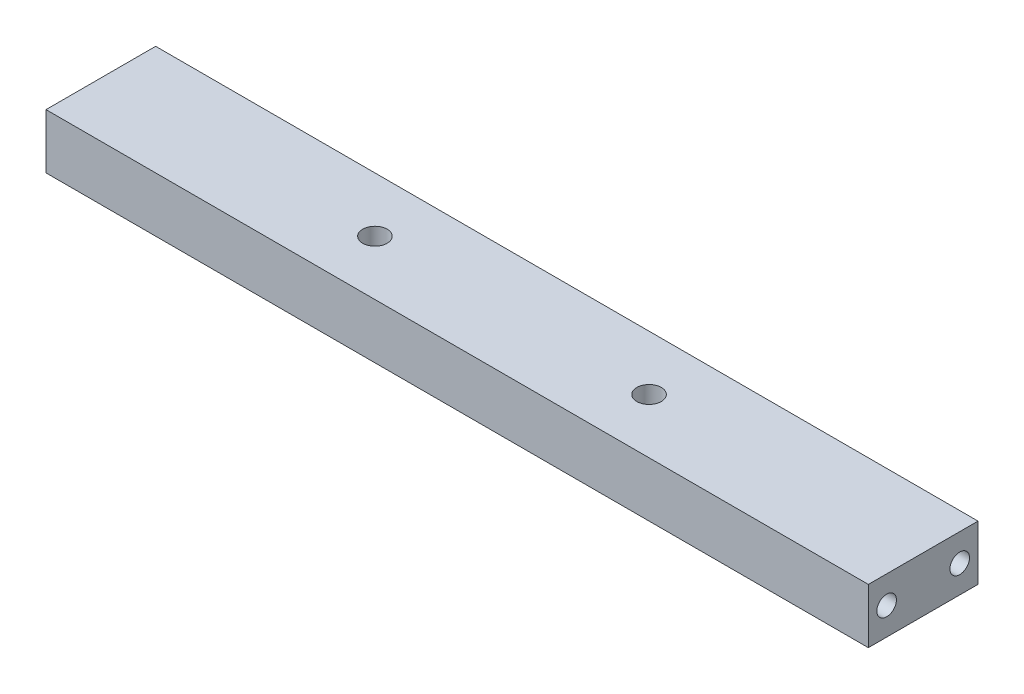
ISO-10303-21;
HEADER;
FILE_DESCRIPTION(('STEP AP214'),'2;1');
FILE_NAME('part.step','',(''),(''),'','','');
FILE_SCHEMA(('AUTOMOTIVE_DESIGN { 1 0 10303 214 1 1 1 1 }'));
ENDSEC;
DATA;
#1=APPLICATION_CONTEXT('core data for automotive mechanical design processes');
#2=APPLICATION_PROTOCOL_DEFINITION('international standard','automotive_design',2000,#1);
#3=PRODUCT_CONTEXT('',#1,'mechanical');
#4=PRODUCT('Part','Part','',(#3));
#5=PRODUCT_RELATED_PRODUCT_CATEGORY('part','',(#4));
#6=PRODUCT_DEFINITION_FORMATION('','',#4);
#7=PRODUCT_DEFINITION_CONTEXT('part definition',#1,'design');
#8=PRODUCT_DEFINITION('design','',#6,#7);
#9=PRODUCT_DEFINITION_SHAPE('','',#8);
#10=(LENGTH_UNIT() NAMED_UNIT(*) SI_UNIT(.MILLI.,.METRE.));
#11=(NAMED_UNIT(*) PLANE_ANGLE_UNIT() SI_UNIT($,.RADIAN.));
#12=(NAMED_UNIT(*) SI_UNIT($,.STERADIAN.) SOLID_ANGLE_UNIT());
#13=UNCERTAINTY_MEASURE_WITH_UNIT(LENGTH_MEASURE(1.E-05),#10,'distance_accuracy_value','');
#14=(GEOMETRIC_REPRESENTATION_CONTEXT(3) GLOBAL_UNCERTAINTY_ASSIGNED_CONTEXT((#13)) GLOBAL_UNIT_ASSIGNED_CONTEXT((#10,
#11,#12)) REPRESENTATION_CONTEXT('',''));
#15=CARTESIAN_POINT('',(0.,0.,0.));
#16=DIRECTION('',(0.,0.,1.));
#17=DIRECTION('',(1.,0.,0.));
#18=AXIS2_PLACEMENT_3D('',#15,#16,#17);
#19=CARTESIAN_POINT('',(142.875,9.525,19.05));
#20=DIRECTION('',(0.,0.,-1.));
#21=DIRECTION('',(0.,1.,0.));
#22=AXIS2_PLACEMENT_3D('',#19,#20,#21);
#23=PLANE('',#22);
#24=DIRECTION('',(0.,-1.,0.));
#25=VECTOR('',#24,1.);
#26=CARTESIAN_POINT('',(-142.875,9.525,19.05));
#27=LINE('',#26,#25);
#28=CARTESIAN_POINT('',(-142.875,9.525,19.05));
#29=VERTEX_POINT('',#28);
#30=CARTESIAN_POINT('',(-142.875,-9.525,19.05));
#31=VERTEX_POINT('',#30);
#32=EDGE_CURVE('E197',#29,#31,#27,.T.);
#33=ORIENTED_EDGE('',*,*,#32,.T.);
#34=DIRECTION('',(-1.,0.,0.));
#35=VECTOR('',#34,1.);
#36=CARTESIAN_POINT('',(142.875,-9.525,19.05));
#37=LINE('',#36,#35);
#38=CARTESIAN_POINT('',(142.875,-9.525,19.05));
#39=VERTEX_POINT('',#38);
#40=EDGE_CURVE('E11',#39,#31,#37,.T.);
#41=ORIENTED_EDGE('',*,*,#40,.F.);
#42=DIRECTION('',(0.,-1.,0.));
#43=VECTOR('',#42,1.);
#44=CARTESIAN_POINT('',(142.875,9.525,19.05));
#45=LINE('',#44,#43);
#46=CARTESIAN_POINT('',(142.875,9.525,19.05));
#47=VERTEX_POINT('',#46);
#48=EDGE_CURVE('E198',#47,#39,#45,.T.);
#49=ORIENTED_EDGE('',*,*,#48,.F.);
#50=DIRECTION('',(-1.,0.,0.));
#51=VECTOR('',#50,1.);
#52=CARTESIAN_POINT('',(142.875,9.525,19.05));
#53=LINE('',#52,#51);
#54=EDGE_CURVE('E204',#47,#29,#53,.T.);
#55=ORIENTED_EDGE('',*,*,#54,.T.);
#56=EDGE_LOOP('',(#33,#41,#49,#55));
#57=FACE_BOUND('',#56,.T.);
#58=ADVANCED_FACE('F38',(#57),#23,.F.);
#59=CARTESIAN_POINT('',(142.875,-9.525,19.05));
#60=DIRECTION('',(0.,1.,0.));
#61=DIRECTION('',(0.,0.,1.));
#62=AXIS2_PLACEMENT_3D('',#59,#60,#61);
#63=PLANE('',#62);
#64=CARTESIAN_POINT('',(19.05,-9.525,-12.7));
#65=DIRECTION('',(0.,-1.,0.));
#66=DIRECTION('',(0.,0.,-1.));
#67=AXIS2_PLACEMENT_3D('',#64,#65,#66);
#68=CIRCLE('',#67,2.1);
#69=CARTESIAN_POINT('',(19.05,-9.525,-14.8));
#70=VERTEX_POINT('',#69);
#71=EDGE_CURVE('E127',#70,#70,#68,.T.);
#72=ORIENTED_EDGE('',*,*,#71,.F.);
#73=EDGE_LOOP('',(#72));
#74=FACE_BOUND('',#73,.T.);
#75=CARTESIAN_POINT('',(-19.05,-9.525,-12.7));
#76=DIRECTION('',(0.,-1.,0.));
#77=DIRECTION('',(0.,0.,-1.));
#78=AXIS2_PLACEMENT_3D('',#75,#76,#77);
#79=CIRCLE('',#78,2.1);
#80=CARTESIAN_POINT('',(-19.05,-9.525,-14.8));
#81=VERTEX_POINT('',#80);
#82=EDGE_CURVE('E126',#81,#81,#79,.T.);
#83=ORIENTED_EDGE('',*,*,#82,.F.);
#84=EDGE_LOOP('',(#83));
#85=FACE_BOUND('',#84,.T.);
#86=CARTESIAN_POINT('',(-19.05,-9.525,12.7));
#87=DIRECTION('',(0.,-1.,0.));
#88=DIRECTION('',(0.,0.,-1.));
#89=AXIS2_PLACEMENT_3D('',#86,#87,#88);
#90=CIRCLE('',#89,2.1);
#91=CARTESIAN_POINT('',(-19.05,-9.525,10.6));
#92=VERTEX_POINT('',#91);
#93=EDGE_CURVE('E137',#92,#92,#90,.T.);
#94=ORIENTED_EDGE('',*,*,#93,.F.);
#95=EDGE_LOOP('',(#94));
#96=FACE_BOUND('',#95,.T.);
#97=CARTESIAN_POINT('',(19.05,-9.525,12.7));
#98=DIRECTION('',(0.,-1.,0.));
#99=DIRECTION('',(0.,0.,-1.));
#100=AXIS2_PLACEMENT_3D('',#97,#98,#99);
#101=CIRCLE('',#100,2.1);
#102=CARTESIAN_POINT('',(19.05,-9.525,10.6));
#103=VERTEX_POINT('',#102);
#104=EDGE_CURVE('E143',#103,#103,#101,.T.);
#105=ORIENTED_EDGE('',*,*,#104,.F.);
#106=EDGE_LOOP('',(#105));
#107=FACE_BOUND('',#106,.T.);
#108=CARTESIAN_POINT('',(-47.625,-9.525,0.));
#109=DIRECTION('',(0.,1.,0.));
#110=DIRECTION('',(0.,0.,1.));
#111=AXIS2_PLACEMENT_3D('',#108,#109,#110);
#112=CIRCLE('',#111,4.25);
#113=CARTESIAN_POINT('',(-47.625,-9.525,4.25));
#114=VERTEX_POINT('',#113);
#115=EDGE_CURVE('E164',#114,#114,#112,.T.);
#116=ORIENTED_EDGE('',*,*,#115,.T.);
#117=EDGE_LOOP('',(#116));
#118=FACE_BOUND('',#117,.T.);
#119=CARTESIAN_POINT('',(47.625,-9.525,0.));
#120=DIRECTION('',(0.,1.,0.));
#121=DIRECTION('',(0.,0.,1.));
#122=AXIS2_PLACEMENT_3D('',#119,#120,#121);
#123=CIRCLE('',#122,4.25);
#124=CARTESIAN_POINT('',(47.625,-9.525,4.25));
#125=VERTEX_POINT('',#124);
#126=EDGE_CURVE('E170',#125,#125,#123,.T.);
#127=ORIENTED_EDGE('',*,*,#126,.T.);
#128=EDGE_LOOP('',(#127));
#129=FACE_BOUND('',#128,.T.);
#130=DIRECTION('',(0.,0.,-1.));
#131=VECTOR('',#130,1.);
#132=CARTESIAN_POINT('',(-142.875,-9.525,19.05));
#133=LINE('',#132,#131);
#134=CARTESIAN_POINT('',(-142.875,-9.525,-19.05));
#135=VERTEX_POINT('',#134);
#136=EDGE_CURVE('E207',#31,#135,#133,.T.);
#137=ORIENTED_EDGE('',*,*,#136,.T.);
#138=DIRECTION('',(-1.,0.,0.));
#139=VECTOR('',#138,1.);
#140=CARTESIAN_POINT('',(142.875,-9.525,-19.05));
#141=LINE('',#140,#139);
#142=CARTESIAN_POINT('',(142.875,-9.525,-19.05));
#143=VERTEX_POINT('',#142);
#144=EDGE_CURVE('E46',#143,#135,#141,.T.);
#145=ORIENTED_EDGE('',*,*,#144,.F.);
#146=DIRECTION('',(0.,0.,-1.));
#147=VECTOR('',#146,1.);
#148=CARTESIAN_POINT('',(142.875,-9.525,19.05));
#149=LINE('',#148,#147);
#150=EDGE_CURVE('E85',#39,#143,#149,.T.);
#151=ORIENTED_EDGE('',*,*,#150,.F.);
#152=ORIENTED_EDGE('',*,*,#40,.T.);
#153=EDGE_LOOP('',(#137,#145,#151,#152));
#154=FACE_BOUND('',#153,.T.);
#155=ADVANCED_FACE('F232',(#74,#85,#96,#107,#118,#129,#154),#63,.F.);
#156=CARTESIAN_POINT('',(142.875,9.525,-19.05));
#157=DIRECTION('',(0.,0.,1.));
#158=DIRECTION('',(0.,-1.,0.));
#159=AXIS2_PLACEMENT_3D('',#156,#157,#158);
#160=PLANE('',#159);
#161=CARTESIAN_POINT('',(63.5,0.,-19.05));
#162=DIRECTION('',(0.,0.,-1.));
#163=DIRECTION('',(-1.,0.,0.));
#164=AXIS2_PLACEMENT_3D('',#161,#162,#163);
#165=CIRCLE('',#164,2.1);
#166=CARTESIAN_POINT('',(61.4,0.,-19.05));
#167=VERTEX_POINT('',#166);
#168=EDGE_CURVE('E149',#167,#167,#165,.T.);
#169=ORIENTED_EDGE('',*,*,#168,.F.);
#170=EDGE_LOOP('',(#169));
#171=FACE_BOUND('',#170,.T.);
#172=CARTESIAN_POINT('',(-63.5,0.,-19.05));
#173=DIRECTION('',(0.,0.,-1.));
#174=DIRECTION('',(-1.,0.,0.));
#175=AXIS2_PLACEMENT_3D('',#172,#173,#174);
#176=CIRCLE('',#175,2.1);
#177=CARTESIAN_POINT('',(-65.6,0.,-19.05));
#178=VERTEX_POINT('',#177);
#179=EDGE_CURVE('E155',#178,#178,#176,.T.);
#180=ORIENTED_EDGE('',*,*,#179,.F.);
#181=EDGE_LOOP('',(#180));
#182=FACE_BOUND('',#181,.T.);
#183=DIRECTION('',(0.,1.,0.));
#184=VECTOR('',#183,1.);
#185=CARTESIAN_POINT('',(-142.875,9.525,-19.05));
#186=LINE('',#185,#184);
#187=CARTESIAN_POINT('',(-142.875,9.525,-19.05));
#188=VERTEX_POINT('',#187);
#189=EDGE_CURVE('E72',#135,#188,#186,.T.);
#190=ORIENTED_EDGE('',*,*,#189,.T.);
#191=DIRECTION('',(-1.,0.,0.));
#192=VECTOR('',#191,1.);
#193=CARTESIAN_POINT('',(142.875,9.525,-19.05));
#194=LINE('',#193,#192);
#195=CARTESIAN_POINT('',(142.875,9.525,-19.05));
#196=VERTEX_POINT('',#195);
#197=EDGE_CURVE('E212',#196,#188,#194,.T.);
#198=ORIENTED_EDGE('',*,*,#197,.F.);
#199=DIRECTION('',(0.,1.,0.));
#200=VECTOR('',#199,1.);
#201=CARTESIAN_POINT('',(142.875,9.525,-19.05));
#202=LINE('',#201,#200);
#203=EDGE_CURVE('E201',#143,#196,#202,.T.);
#204=ORIENTED_EDGE('',*,*,#203,.F.);
#205=ORIENTED_EDGE('',*,*,#144,.T.);
#206=EDGE_LOOP('',(#190,#198,#204,#205));
#207=FACE_BOUND('',#206,.T.);
#208=ADVANCED_FACE('F214',(#171,#182,#207),#160,.F.);
#209=CARTESIAN_POINT('',(142.875,9.525,19.05));
#210=DIRECTION('',(0.,-1.,0.));
#211=DIRECTION('',(0.,0.,-1.));
#212=AXIS2_PLACEMENT_3D('',#209,#210,#211);
#213=PLANE('',#212);
#214=CARTESIAN_POINT('',(-47.625,9.525,0.));
#215=DIRECTION('',(0.,1.,0.));
#216=DIRECTION('',(0.,0.,1.));
#217=AXIS2_PLACEMENT_3D('',#214,#215,#216);
#218=CIRCLE('',#217,4.24999999999999);
#219=CARTESIAN_POINT('',(-47.625,9.525,4.24999999999999));
#220=VERTEX_POINT('',#219);
#221=EDGE_CURVE('E161',#220,#220,#218,.T.);
#222=ORIENTED_EDGE('',*,*,#221,.F.);
#223=EDGE_LOOP('',(#222));
#224=FACE_BOUND('',#223,.T.);
#225=CARTESIAN_POINT('',(47.625,9.525,0.));
#226=DIRECTION('',(0.,1.,0.));
#227=DIRECTION('',(0.,0.,1.));
#228=AXIS2_PLACEMENT_3D('',#225,#226,#227);
#229=CIRCLE('',#228,4.24999999999999);
#230=CARTESIAN_POINT('',(47.625,9.525,4.24999999999999));
#231=VERTEX_POINT('',#230);
#232=EDGE_CURVE('E167',#231,#231,#229,.T.);
#233=ORIENTED_EDGE('',*,*,#232,.F.);
#234=EDGE_LOOP('',(#233));
#235=FACE_BOUND('',#234,.T.);
#236=DIRECTION('',(0.,0.,1.));
#237=VECTOR('',#236,1.);
#238=CARTESIAN_POINT('',(-142.875,9.525,19.05));
#239=LINE('',#238,#237);
#240=EDGE_CURVE('E78',#188,#29,#239,.T.);
#241=ORIENTED_EDGE('',*,*,#240,.T.);
#242=ORIENTED_EDGE('',*,*,#54,.F.);
#243=DIRECTION('',(0.,0.,1.));
#244=VECTOR('',#243,1.);
#245=CARTESIAN_POINT('',(142.875,9.525,19.05));
#246=LINE('',#245,#244);
#247=EDGE_CURVE('E54',#196,#47,#246,.T.);
#248=ORIENTED_EDGE('',*,*,#247,.F.);
#249=ORIENTED_EDGE('',*,*,#197,.T.);
#250=EDGE_LOOP('',(#241,#242,#248,#249));
#251=FACE_BOUND('',#250,.T.);
#252=ADVANCED_FACE('F221',(#224,#235,#251),#213,.F.);
#253=CARTESIAN_POINT('',(142.875,9.525,19.05));
#254=DIRECTION('',(1.,0.,0.));
#255=DIRECTION('',(0.,0.,-1.));
#256=AXIS2_PLACEMENT_3D('',#253,#254,#255);
#257=PLANE('',#256);
#258=CARTESIAN_POINT('',(142.875,0.,12.7));
#259=DIRECTION('',(1.,0.,0.));
#260=DIRECTION('',(0.,0.,-1.));
#261=AXIS2_PLACEMENT_3D('',#258,#259,#260);
#262=CIRCLE('',#261,3.4);
#263=CARTESIAN_POINT('',(142.875,0.,9.3));
#264=VERTEX_POINT('',#263);
#265=EDGE_CURVE('E188',#264,#264,#262,.T.);
#266=ORIENTED_EDGE('',*,*,#265,.F.);
#267=EDGE_LOOP('',(#266));
#268=FACE_BOUND('',#267,.T.);
#269=CARTESIAN_POINT('',(142.875,0.,-12.7));
#270=DIRECTION('',(1.,0.,0.));
#271=DIRECTION('',(0.,0.,-1.));
#272=AXIS2_PLACEMENT_3D('',#269,#270,#271);
#273=CIRCLE('',#272,3.4);
#274=CARTESIAN_POINT('',(142.875,0.,-16.1));
#275=VERTEX_POINT('',#274);
#276=EDGE_CURVE('E194',#275,#275,#273,.T.);
#277=ORIENTED_EDGE('',*,*,#276,.F.);
#278=EDGE_LOOP('',(#277));
#279=FACE_BOUND('',#278,.T.);
#280=ORIENTED_EDGE('',*,*,#48,.T.);
#281=ORIENTED_EDGE('',*,*,#150,.T.);
#282=ORIENTED_EDGE('',*,*,#203,.T.);
#283=ORIENTED_EDGE('',*,*,#247,.T.);
#284=EDGE_LOOP('',(#280,#281,#282,#283));
#285=FACE_BOUND('',#284,.T.);
#286=ADVANCED_FACE('F223',(#268,#279,#285),#257,.T.);
#287=CARTESIAN_POINT('',(-142.875,9.525,19.05));
#288=DIRECTION('',(1.,0.,0.));
#289=DIRECTION('',(0.,0.,-1.));
#290=AXIS2_PLACEMENT_3D('',#287,#288,#289);
#291=PLANE('',#290);
#292=CARTESIAN_POINT('',(-142.875,0.,12.7));
#293=DIRECTION('',(-1.,0.,0.));
#294=DIRECTION('',(0.,0.,1.));
#295=AXIS2_PLACEMENT_3D('',#292,#293,#294);
#296=CIRCLE('',#295,3.4);
#297=CARTESIAN_POINT('',(-142.875,0.,16.1));
#298=VERTEX_POINT('',#297);
#299=EDGE_CURVE('E176',#298,#298,#296,.T.);
#300=ORIENTED_EDGE('',*,*,#299,.F.);
#301=EDGE_LOOP('',(#300));
#302=FACE_BOUND('',#301,.T.);
#303=CARTESIAN_POINT('',(-142.875,0.,-12.7));
#304=DIRECTION('',(-1.,0.,0.));
#305=DIRECTION('',(0.,0.,1.));
#306=AXIS2_PLACEMENT_3D('',#303,#304,#305);
#307=CIRCLE('',#306,3.4);
#308=CARTESIAN_POINT('',(-142.875,0.,-9.3));
#309=VERTEX_POINT('',#308);
#310=EDGE_CURVE('E182',#309,#309,#307,.T.);
#311=ORIENTED_EDGE('',*,*,#310,.F.);
#312=EDGE_LOOP('',(#311));
#313=FACE_BOUND('',#312,.T.);
#314=ORIENTED_EDGE('',*,*,#32,.F.);
#315=ORIENTED_EDGE('',*,*,#240,.F.);
#316=ORIENTED_EDGE('',*,*,#189,.F.);
#317=ORIENTED_EDGE('',*,*,#136,.F.);
#318=EDGE_LOOP('',(#314,#315,#316,#317));
#319=FACE_BOUND('',#318,.T.);
#320=ADVANCED_FACE('F217',(#302,#313,#319),#291,.F.);
#321=CARTESIAN_POINT('',(142.875,0.,-12.7));
#322=DIRECTION('',(1.,0.,0.));
#323=DIRECTION('',(0.,0.,-1.));
#324=AXIS2_PLACEMENT_3D('',#321,#322,#323);
#325=CYLINDRICAL_SURFACE('',#324,3.4);
#326=CARTESIAN_POINT('',(123.1138,0.,-12.7));
#327=DIRECTION('',(1.,0.,0.));
#328=DIRECTION('',(0.,0.,-1.));
#329=AXIS2_PLACEMENT_3D('',#326,#327,#328);
#330=CIRCLE('',#329,3.4);
#331=CARTESIAN_POINT('',(123.1138,0.,-16.1));
#332=VERTEX_POINT('',#331);
#333=EDGE_CURVE('E191',#332,#332,#330,.T.);
#334=ORIENTED_EDGE('',*,*,#333,.F.);
#335=EDGE_LOOP('',(#334));
#336=FACE_BOUND('',#335,.T.);
#337=ORIENTED_EDGE('',*,*,#276,.T.);
#338=EDGE_LOOP('',(#337));
#339=FACE_BOUND('',#338,.T.);
#340=ADVANCED_FACE('F298',(#336,#339),#325,.F.);
#341=CARTESIAN_POINT('',(123.1138,0.,-12.7));
#342=DIRECTION('',(1.,0.,0.));
#343=DIRECTION('',(0.,0.,-1.));
#344=AXIS2_PLACEMENT_3D('',#341,#342,#343);
#345=CONICAL_SURFACE('',#344,3.4,1.02974425867665);
#346=CARTESIAN_POINT('',(121.070873895306,0.,-12.7));
#347=VERTEX_POINT('',#346);
#348=VERTEX_LOOP('',#347);
#349=FACE_BOUND('',#348,.T.);
#350=ORIENTED_EDGE('',*,*,#333,.T.);
#351=EDGE_LOOP('',(#350));
#352=FACE_BOUND('',#351,.T.);
#353=ADVANCED_FACE('F294',(#349,#352),#345,.F.);
#354=CARTESIAN_POINT('',(142.875,0.,12.7));
#355=DIRECTION('',(1.,0.,0.));
#356=DIRECTION('',(0.,0.,-1.));
#357=AXIS2_PLACEMENT_3D('',#354,#355,#356);
#358=CYLINDRICAL_SURFACE('',#357,3.4);
#359=CARTESIAN_POINT('',(123.1138,0.,12.7));
#360=DIRECTION('',(1.,0.,0.));
#361=DIRECTION('',(0.,0.,-1.));
#362=AXIS2_PLACEMENT_3D('',#359,#360,#361);
#363=CIRCLE('',#362,3.4);
#364=CARTESIAN_POINT('',(123.1138,0.,9.3));
#365=VERTEX_POINT('',#364);
#366=EDGE_CURVE('E185',#365,#365,#363,.T.);
#367=ORIENTED_EDGE('',*,*,#366,.F.);
#368=EDGE_LOOP('',(#367));
#369=FACE_BOUND('',#368,.T.);
#370=ORIENTED_EDGE('',*,*,#265,.T.);
#371=EDGE_LOOP('',(#370));
#372=FACE_BOUND('',#371,.T.);
#373=ADVANCED_FACE('F290',(#369,#372),#358,.F.);
#374=CARTESIAN_POINT('',(123.1138,0.,12.7));
#375=DIRECTION('',(1.,0.,0.));
#376=DIRECTION('',(0.,0.,-1.));
#377=AXIS2_PLACEMENT_3D('',#374,#375,#376);
#378=CONICAL_SURFACE('',#377,3.4,1.02974425867665);
#379=CARTESIAN_POINT('',(121.070873895306,0.,12.7));
#380=VERTEX_POINT('',#379);
#381=VERTEX_LOOP('',#380);
#382=FACE_BOUND('',#381,.T.);
#383=ORIENTED_EDGE('',*,*,#366,.T.);
#384=EDGE_LOOP('',(#383));
#385=FACE_BOUND('',#384,.T.);
#386=ADVANCED_FACE('F286',(#382,#385),#378,.F.);
#387=CARTESIAN_POINT('',(-142.875,0.,-12.7));
#388=DIRECTION('',(-1.,0.,0.));
#389=DIRECTION('',(0.,0.,1.));
#390=AXIS2_PLACEMENT_3D('',#387,#388,#389);
#391=CYLINDRICAL_SURFACE('',#390,3.4);
#392=CARTESIAN_POINT('',(-123.1138,0.,-12.7));
#393=DIRECTION('',(-1.,0.,0.));
#394=DIRECTION('',(0.,0.,1.));
#395=AXIS2_PLACEMENT_3D('',#392,#393,#394);
#396=CIRCLE('',#395,3.4);
#397=CARTESIAN_POINT('',(-123.1138,0.,-9.3));
#398=VERTEX_POINT('',#397);
#399=EDGE_CURVE('E179',#398,#398,#396,.T.);
#400=ORIENTED_EDGE('',*,*,#399,.F.);
#401=EDGE_LOOP('',(#400));
#402=FACE_BOUND('',#401,.T.);
#403=ORIENTED_EDGE('',*,*,#310,.T.);
#404=EDGE_LOOP('',(#403));
#405=FACE_BOUND('',#404,.T.);
#406=ADVANCED_FACE('F282',(#402,#405),#391,.F.);
#407=CARTESIAN_POINT('',(-123.1138,0.,-12.7));
#408=DIRECTION('',(-1.,0.,0.));
#409=DIRECTION('',(0.,0.,1.));
#410=AXIS2_PLACEMENT_3D('',#407,#408,#409);
#411=CONICAL_SURFACE('',#410,3.4,1.02974425867665);
#412=CARTESIAN_POINT('',(-121.070873895306,0.,-12.7));
#413=VERTEX_POINT('',#412);
#414=VERTEX_LOOP('',#413);
#415=FACE_BOUND('',#414,.T.);
#416=ORIENTED_EDGE('',*,*,#399,.T.);
#417=EDGE_LOOP('',(#416));
#418=FACE_BOUND('',#417,.T.);
#419=ADVANCED_FACE('F278',(#415,#418),#411,.F.);
#420=CARTESIAN_POINT('',(-142.875,0.,12.7));
#421=DIRECTION('',(-1.,0.,0.));
#422=DIRECTION('',(0.,0.,1.));
#423=AXIS2_PLACEMENT_3D('',#420,#421,#422);
#424=CYLINDRICAL_SURFACE('',#423,3.4);
#425=CARTESIAN_POINT('',(-123.1138,0.,12.7));
#426=DIRECTION('',(-1.,0.,0.));
#427=DIRECTION('',(0.,0.,1.));
#428=AXIS2_PLACEMENT_3D('',#425,#426,#427);
#429=CIRCLE('',#428,3.4);
#430=CARTESIAN_POINT('',(-123.1138,0.,16.1));
#431=VERTEX_POINT('',#430);
#432=EDGE_CURVE('E173',#431,#431,#429,.T.);
#433=ORIENTED_EDGE('',*,*,#432,.F.);
#434=EDGE_LOOP('',(#433));
#435=FACE_BOUND('',#434,.T.);
#436=ORIENTED_EDGE('',*,*,#299,.T.);
#437=EDGE_LOOP('',(#436));
#438=FACE_BOUND('',#437,.T.);
#439=ADVANCED_FACE('F271',(#435,#438),#424,.F.);
#440=CARTESIAN_POINT('',(-123.1138,0.,12.7));
#441=DIRECTION('',(-1.,0.,0.));
#442=DIRECTION('',(0.,0.,1.));
#443=AXIS2_PLACEMENT_3D('',#440,#441,#442);
#444=CONICAL_SURFACE('',#443,3.4,1.02974425867665);
#445=CARTESIAN_POINT('',(-121.070873895306,0.,12.7));
#446=VERTEX_POINT('',#445);
#447=VERTEX_LOOP('',#446);
#448=FACE_BOUND('',#447,.T.);
#449=ORIENTED_EDGE('',*,*,#432,.T.);
#450=EDGE_LOOP('',(#449));
#451=FACE_BOUND('',#450,.T.);
#452=ADVANCED_FACE('F261',(#448,#451),#444,.F.);
#453=CARTESIAN_POINT('',(47.625,9.525,0.));
#454=DIRECTION('',(0.,1.,0.));
#455=DIRECTION('',(0.,0.,1.));
#456=AXIS2_PLACEMENT_3D('',#453,#454,#455);
#457=CYLINDRICAL_SURFACE('',#456,4.24999999999999);
#458=ORIENTED_EDGE('',*,*,#126,.F.);
#459=EDGE_LOOP('',(#458));
#460=FACE_BOUND('',#459,.T.);
#461=ORIENTED_EDGE('',*,*,#232,.T.);
#462=EDGE_LOOP('',(#461));
#463=FACE_BOUND('',#462,.T.);
#464=ADVANCED_FACE('F257',(#460,#463),#457,.F.);
#465=CARTESIAN_POINT('',(-47.625,9.525,0.));
#466=DIRECTION('',(0.,1.,0.));
#467=DIRECTION('',(0.,0.,1.));
#468=AXIS2_PLACEMENT_3D('',#465,#466,#467);
#469=CYLINDRICAL_SURFACE('',#468,4.24999999999999);
#470=ORIENTED_EDGE('',*,*,#115,.F.);
#471=EDGE_LOOP('',(#470));
#472=FACE_BOUND('',#471,.T.);
#473=ORIENTED_EDGE('',*,*,#221,.T.);
#474=EDGE_LOOP('',(#473));
#475=FACE_BOUND('',#474,.T.);
#476=ADVANCED_FACE('F260',(#472,#475),#469,.F.);
#477=CARTESIAN_POINT('',(-63.5,0.,-6.6548));
#478=DIRECTION('',(0.,0.,-1.));
#479=DIRECTION('',(-1.,0.,0.));
#480=AXIS2_PLACEMENT_3D('',#477,#478,#479);
#481=CONICAL_SURFACE('',#480,2.1,1.02974425867665);
#482=CARTESIAN_POINT('',(-63.5,0.,-5.39299270004213));
#483=VERTEX_POINT('',#482);
#484=VERTEX_LOOP('',#483);
#485=FACE_BOUND('',#484,.T.);
#486=CARTESIAN_POINT('',(-63.5,0.,-6.6548));
#487=DIRECTION('',(0.,0.,-1.));
#488=DIRECTION('',(-1.,0.,0.));
#489=AXIS2_PLACEMENT_3D('',#486,#487,#488);
#490=CIRCLE('',#489,2.1);
#491=CARTESIAN_POINT('',(-65.6,0.,-6.6548));
#492=VERTEX_POINT('',#491);
#493=EDGE_CURVE('E158',#492,#492,#490,.T.);
#494=ORIENTED_EDGE('',*,*,#493,.T.);
#495=EDGE_LOOP('',(#494));
#496=FACE_BOUND('',#495,.T.);
#497=ADVANCED_FACE('F268',(#485,#496),#481,.F.);
#498=CARTESIAN_POINT('',(-63.5,0.,-19.05));
#499=DIRECTION('',(0.,0.,-1.));
#500=DIRECTION('',(-1.,0.,0.));
#501=AXIS2_PLACEMENT_3D('',#498,#499,#500);
#502=CYLINDRICAL_SURFACE('',#501,2.1);
#503=ORIENTED_EDGE('',*,*,#493,.F.);
#504=EDGE_LOOP('',(#503));
#505=FACE_BOUND('',#504,.T.);
#506=ORIENTED_EDGE('',*,*,#179,.T.);
#507=EDGE_LOOP('',(#506));
#508=FACE_BOUND('',#507,.T.);
#509=ADVANCED_FACE('F383',(#505,#508),#502,.F.);
#510=CARTESIAN_POINT('',(63.5,0.,-6.6548));
#511=DIRECTION('',(0.,0.,-1.));
#512=DIRECTION('',(-1.,0.,0.));
#513=AXIS2_PLACEMENT_3D('',#510,#511,#512);
#514=CONICAL_SURFACE('',#513,2.09999999999999,1.02974425867665);
#515=CARTESIAN_POINT('',(63.5,0.,-5.39299270004213));
#516=VERTEX_POINT('',#515);
#517=VERTEX_LOOP('',#516);
#518=FACE_BOUND('',#517,.T.);
#519=CARTESIAN_POINT('',(63.5,0.,-6.6548));
#520=DIRECTION('',(0.,0.,-1.));
#521=DIRECTION('',(-1.,0.,0.));
#522=AXIS2_PLACEMENT_3D('',#519,#520,#521);
#523=CIRCLE('',#522,2.09999999999999);
#524=CARTESIAN_POINT('',(61.4,0.,-6.6548));
#525=VERTEX_POINT('',#524);
#526=EDGE_CURVE('E152',#525,#525,#523,.T.);
#527=ORIENTED_EDGE('',*,*,#526,.T.);
#528=EDGE_LOOP('',(#527));
#529=FACE_BOUND('',#528,.T.);
#530=ADVANCED_FACE('F393',(#518,#529),#514,.F.);
#531=CARTESIAN_POINT('',(63.5,0.,-19.05));
#532=DIRECTION('',(0.,0.,-1.));
#533=DIRECTION('',(-1.,0.,0.));
#534=AXIS2_PLACEMENT_3D('',#531,#532,#533);
#535=CYLINDRICAL_SURFACE('',#534,2.1);
#536=ORIENTED_EDGE('',*,*,#526,.F.);
#537=EDGE_LOOP('',(#536));
#538=FACE_BOUND('',#537,.T.);
#539=ORIENTED_EDGE('',*,*,#168,.T.);
#540=EDGE_LOOP('',(#539));
#541=FACE_BOUND('',#540,.T.);
#542=ADVANCED_FACE('F404',(#538,#541),#535,.F.);
#543=CARTESIAN_POINT('',(19.05,2.8702,12.7));
#544=DIRECTION('',(0.,-1.,0.));
#545=DIRECTION('',(0.,0.,-1.));
#546=AXIS2_PLACEMENT_3D('',#543,#544,#545);
#547=CONICAL_SURFACE('',#546,2.1,1.02974425867665);
#548=CARTESIAN_POINT('',(19.05,4.13200729995787,12.7));
#549=VERTEX_POINT('',#548);
#550=VERTEX_LOOP('',#549);
#551=FACE_BOUND('',#550,.T.);
#552=CARTESIAN_POINT('',(19.05,2.8702,12.7));
#553=DIRECTION('',(0.,-1.,0.));
#554=DIRECTION('',(0.,0.,-1.));
#555=AXIS2_PLACEMENT_3D('',#552,#553,#554);
#556=CIRCLE('',#555,2.1);
#557=CARTESIAN_POINT('',(19.05,2.8702,10.6));
#558=VERTEX_POINT('',#557);
#559=EDGE_CURVE('E146',#558,#558,#556,.T.);
#560=ORIENTED_EDGE('',*,*,#559,.T.);
#561=EDGE_LOOP('',(#560));
#562=FACE_BOUND('',#561,.T.);
#563=ADVANCED_FACE('F413',(#551,#562),#547,.F.);
#564=CARTESIAN_POINT('',(19.05,-9.525,12.7));
#565=DIRECTION('',(0.,-1.,0.));
#566=DIRECTION('',(0.,0.,-1.));
#567=AXIS2_PLACEMENT_3D('',#564,#565,#566);
#568=CYLINDRICAL_SURFACE('',#567,2.1);
#569=ORIENTED_EDGE('',*,*,#559,.F.);
#570=EDGE_LOOP('',(#569));
#571=FACE_BOUND('',#570,.T.);
#572=ORIENTED_EDGE('',*,*,#104,.T.);
#573=EDGE_LOOP('',(#572));
#574=FACE_BOUND('',#573,.T.);
#575=ADVANCED_FACE('F429',(#571,#574),#568,.F.);
#576=CARTESIAN_POINT('',(-19.05,2.8702,12.7));
#577=DIRECTION('',(0.,-1.,0.));
#578=DIRECTION('',(0.,0.,-1.));
#579=AXIS2_PLACEMENT_3D('',#576,#577,#578);
#580=CONICAL_SURFACE('',#579,2.1,1.02974425867665);
#581=CARTESIAN_POINT('',(-19.05,4.13200729995787,12.7));
#582=VERTEX_POINT('',#581);
#583=VERTEX_LOOP('',#582);
#584=FACE_BOUND('',#583,.T.);
#585=CARTESIAN_POINT('',(-19.05,2.8702,12.7));
#586=DIRECTION('',(0.,-1.,0.));
#587=DIRECTION('',(0.,0.,-1.));
#588=AXIS2_PLACEMENT_3D('',#585,#586,#587);
#589=CIRCLE('',#588,2.1);
#590=CARTESIAN_POINT('',(-19.05,2.8702,10.6));
#591=VERTEX_POINT('',#590);
#592=EDGE_CURVE('E140',#591,#591,#589,.T.);
#593=ORIENTED_EDGE('',*,*,#592,.T.);
#594=EDGE_LOOP('',(#593));
#595=FACE_BOUND('',#594,.T.);
#596=ADVANCED_FACE('F440',(#584,#595),#580,.F.);
#597=CARTESIAN_POINT('',(-19.05,-9.525,12.7));
#598=DIRECTION('',(0.,-1.,0.));
#599=DIRECTION('',(0.,0.,-1.));
#600=AXIS2_PLACEMENT_3D('',#597,#598,#599);
#601=CYLINDRICAL_SURFACE('',#600,2.1);
#602=ORIENTED_EDGE('',*,*,#592,.F.);
#603=EDGE_LOOP('',(#602));
#604=FACE_BOUND('',#603,.T.);
#605=ORIENTED_EDGE('',*,*,#93,.T.);
#606=EDGE_LOOP('',(#605));
#607=FACE_BOUND('',#606,.T.);
#608=ADVANCED_FACE('F452',(#604,#607),#601,.F.);
#609=CARTESIAN_POINT('',(-19.05,2.8702,-12.7));
#610=DIRECTION('',(0.,-1.,0.));
#611=DIRECTION('',(0.,0.,-1.));
#612=AXIS2_PLACEMENT_3D('',#609,#610,#611);
#613=CONICAL_SURFACE('',#612,2.1,1.02974425867665);
#614=CARTESIAN_POINT('',(-19.05,4.13200729995787,-12.7));
#615=VERTEX_POINT('',#614);
#616=VERTEX_LOOP('',#615);
#617=FACE_BOUND('',#616,.T.);
#618=CARTESIAN_POINT('',(-19.05,2.8702,-12.7));
#619=DIRECTION('',(0.,-1.,0.));
#620=DIRECTION('',(0.,0.,-1.));
#621=AXIS2_PLACEMENT_3D('',#618,#619,#620);
#622=CIRCLE('',#621,2.1);
#623=CARTESIAN_POINT('',(-19.05,2.8702,-14.8));
#624=VERTEX_POINT('',#623);
#625=EDGE_CURVE('E130',#624,#624,#622,.T.);
#626=ORIENTED_EDGE('',*,*,#625,.T.);
#627=EDGE_LOOP('',(#626));
#628=FACE_BOUND('',#627,.T.);
#629=ADVANCED_FACE('F462',(#617,#628),#613,.F.);
#630=CARTESIAN_POINT('',(-19.05,-9.525,-12.7));
#631=DIRECTION('',(0.,-1.,0.));
#632=DIRECTION('',(0.,0.,-1.));
#633=AXIS2_PLACEMENT_3D('',#630,#631,#632);
#634=CYLINDRICAL_SURFACE('',#633,2.1);
#635=ORIENTED_EDGE('',*,*,#625,.F.);
#636=EDGE_LOOP('',(#635));
#637=FACE_BOUND('',#636,.T.);
#638=ORIENTED_EDGE('',*,*,#82,.T.);
#639=EDGE_LOOP('',(#638));
#640=FACE_BOUND('',#639,.T.);
#641=ADVANCED_FACE('F120',(#637,#640),#634,.F.);
#642=CARTESIAN_POINT('',(19.05,2.8702,-12.7));
#643=DIRECTION('',(0.,-1.,0.));
#644=DIRECTION('',(0.,0.,-1.));
#645=AXIS2_PLACEMENT_3D('',#642,#643,#644);
#646=CONICAL_SURFACE('',#645,2.1,1.02974425867665);
#647=CARTESIAN_POINT('',(19.05,4.13200729995787,-12.7));
#648=VERTEX_POINT('',#647);
#649=VERTEX_LOOP('',#648);
#650=FACE_BOUND('',#649,.T.);
#651=CARTESIAN_POINT('',(19.05,2.8702,-12.7));
#652=DIRECTION('',(0.,-1.,0.));
#653=DIRECTION('',(0.,0.,-1.));
#654=AXIS2_PLACEMENT_3D('',#651,#652,#653);
#655=CIRCLE('',#654,2.1);
#656=CARTESIAN_POINT('',(19.05,2.8702,-14.8));
#657=VERTEX_POINT('',#656);
#658=EDGE_CURVE('E124',#657,#657,#655,.T.);
#659=ORIENTED_EDGE('',*,*,#658,.T.);
#660=EDGE_LOOP('',(#659));
#661=FACE_BOUND('',#660,.T.);
#662=ADVANCED_FACE('F116',(#650,#661),#646,.F.);
#663=CARTESIAN_POINT('',(19.05,-9.525,-12.7));
#664=DIRECTION('',(0.,-1.,0.));
#665=DIRECTION('',(0.,0.,-1.));
#666=AXIS2_PLACEMENT_3D('',#663,#664,#665);
#667=CYLINDRICAL_SURFACE('',#666,2.1);
#668=ORIENTED_EDGE('',*,*,#658,.F.);
#669=EDGE_LOOP('',(#668));
#670=FACE_BOUND('',#669,.T.);
#671=ORIENTED_EDGE('',*,*,#71,.T.);
#672=EDGE_LOOP('',(#671));
#673=FACE_BOUND('',#672,.T.);
#674=ADVANCED_FACE('F119',(#670,#673),#667,.F.);
#675=CLOSED_SHELL('',(#58,#155,#208,#252,#286,#320,#340,#353,#373,#386,#406,#419,#439,#452,#464,
#476,#497,#509,#530,#542,#563,#575,#596,#608,#629,#641,#662,#674));
#676=MANIFOLD_SOLID_BREP('B2',#675);
#677=ADVANCED_BREP_SHAPE_REPRESENTATION('',(#18,#676),#14);
#678=SHAPE_DEFINITION_REPRESENTATION(#9,#677);
ENDSEC;
END-ISO-10303-21;
